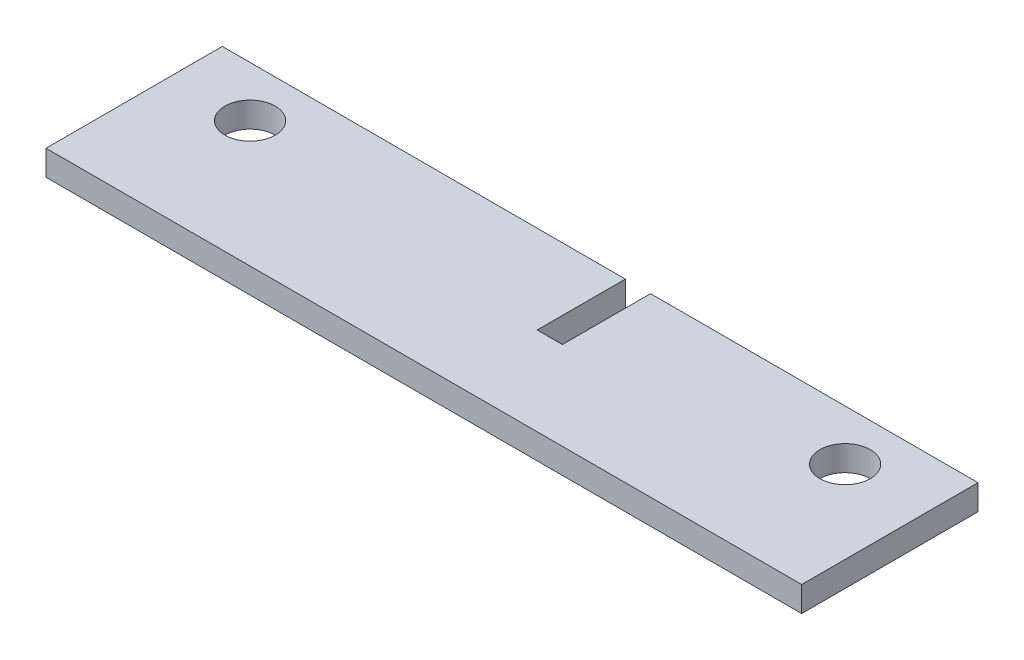
ISO-10303-21;
HEADER;
FILE_DESCRIPTION(('STEP AP214'),'2;1');
FILE_NAME('part.step','',(''),(''),'','','');
FILE_SCHEMA(('AUTOMOTIVE_DESIGN { 1 0 10303 214 1 1 1 1 }'));
ENDSEC;
DATA;
#1=APPLICATION_CONTEXT('core data for automotive mechanical design processes');
#2=APPLICATION_PROTOCOL_DEFINITION('international standard','automotive_design',2000,#1);
#3=PRODUCT_CONTEXT('',#1,'mechanical');
#4=PRODUCT('Part','Part','',(#3));
#5=PRODUCT_RELATED_PRODUCT_CATEGORY('part','',(#4));
#6=PRODUCT_DEFINITION_FORMATION('','',#4);
#7=PRODUCT_DEFINITION_CONTEXT('part definition',#1,'design');
#8=PRODUCT_DEFINITION('design','',#6,#7);
#9=PRODUCT_DEFINITION_SHAPE('','',#8);
#10=(LENGTH_UNIT() NAMED_UNIT(*) SI_UNIT(.MILLI.,.METRE.));
#11=(NAMED_UNIT(*) PLANE_ANGLE_UNIT() SI_UNIT($,.RADIAN.));
#12=(NAMED_UNIT(*) SI_UNIT($,.STERADIAN.) SOLID_ANGLE_UNIT());
#13=UNCERTAINTY_MEASURE_WITH_UNIT(LENGTH_MEASURE(1.E-05),#10,'distance_accuracy_value','');
#14=(GEOMETRIC_REPRESENTATION_CONTEXT(3) GLOBAL_UNCERTAINTY_ASSIGNED_CONTEXT((#13)) GLOBAL_UNIT_ASSIGNED_CONTEXT((#10,
#11,#12)) REPRESENTATION_CONTEXT('',''));
#15=CARTESIAN_POINT('',(0.,0.,0.));
#16=DIRECTION('',(0.,0.,1.));
#17=DIRECTION('',(1.,0.,0.));
#18=AXIS2_PLACEMENT_3D('',#15,#16,#17);
#19=CARTESIAN_POINT('',(0.,0.,249.6));
#20=DIRECTION('',(0.,0.,1.));
#21=DIRECTION('',(1.,0.,0.));
#22=AXIS2_PLACEMENT_3D('',#19,#20,#21);
#23=PLANE('',#22);
#24=DIRECTION('',(-1.,0.,0.));
#25=VECTOR('',#24,1.);
#26=CARTESIAN_POINT('',(2260.6,65.,249.6));
#27=LINE('',#26,#25);
#28=CARTESIAN_POINT('',(2463.8,65.,249.6));
#29=VERTEX_POINT('',#28);
#30=CARTESIAN_POINT('',(2260.6,65.,249.6));
#31=VERTEX_POINT('',#30);
#32=EDGE_CURVE('E180',#29,#31,#27,.T.);
#33=ORIENTED_EDGE('',*,*,#32,.F.);
#34=DIRECTION('',(0.,1.,0.));
#35=VECTOR('',#34,1.);
#36=CARTESIAN_POINT('',(2463.8,52.3,249.6));
#37=LINE('',#36,#35);
#38=CARTESIAN_POINT('',(2463.8,52.3,249.6));
#39=VERTEX_POINT('',#38);
#40=EDGE_CURVE('E151',#39,#29,#37,.T.);
#41=ORIENTED_EDGE('',*,*,#40,.F.);
#42=DIRECTION('',(1.,0.,0.));
#43=VECTOR('',#42,1.);
#44=CARTESIAN_POINT('',(2260.6,52.3,249.6));
#45=LINE('',#44,#43);
#46=CARTESIAN_POINT('',(2260.6,52.3,249.6));
#47=VERTEX_POINT('',#46);
#48=EDGE_CURVE('E144',#47,#39,#45,.T.);
#49=ORIENTED_EDGE('',*,*,#48,.F.);
#50=DIRECTION('',(0.,-1.,0.));
#51=VECTOR('',#50,1.);
#52=CARTESIAN_POINT('',(2260.6,65.,249.6));
#53=LINE('',#52,#51);
#54=EDGE_CURVE('E119',#31,#47,#53,.T.);
#55=ORIENTED_EDGE('',*,*,#54,.F.);
#56=EDGE_LOOP('',(#33,#41,#49,#55));
#57=FACE_BOUND('',#56,.T.);
#58=ADVANCED_FACE('F42',(#57),#23,.F.);
#59=CARTESIAN_POINT('',(2260.6,65.,249.6));
#60=DIRECTION('',(-1.,0.,0.));
#61=DIRECTION('',(0.,0.,1.));
#62=AXIS2_PLACEMENT_3D('',#59,#60,#61);
#63=PLANE('',#62);
#64=DIRECTION('',(0.,0.,1.));
#65=VECTOR('',#64,1.);
#66=CARTESIAN_POINT('',(2260.6,52.3,249.6));
#67=LINE('',#66,#65);
#68=CARTESIAN_POINT('',(2260.6,52.3,338.5));
#69=VERTEX_POINT('',#68);
#70=EDGE_CURVE('E112',#47,#69,#67,.T.);
#71=ORIENTED_EDGE('',*,*,#70,.T.);
#72=DIRECTION('',(0.,-1.,0.));
#73=VECTOR('',#72,1.);
#74=CARTESIAN_POINT('',(2260.6,65.,338.5));
#75=LINE('',#74,#73);
#76=CARTESIAN_POINT('',(2260.6,65.,338.5));
#77=VERTEX_POINT('',#76);
#78=EDGE_CURVE('E117',#77,#69,#75,.T.);
#79=ORIENTED_EDGE('',*,*,#78,.F.);
#80=DIRECTION('',(0.,0.,1.));
#81=VECTOR('',#80,1.);
#82=CARTESIAN_POINT('',(2260.6,65.,249.6));
#83=LINE('',#82,#81);
#84=EDGE_CURVE('E193',#31,#77,#83,.T.);
#85=ORIENTED_EDGE('',*,*,#84,.F.);
#86=ORIENTED_EDGE('',*,*,#54,.T.);
#87=EDGE_LOOP('',(#71,#79,#85,#86));
#88=FACE_BOUND('',#87,.T.);
#89=ADVANCED_FACE('F114',(#88),#63,.T.);
#90=CARTESIAN_POINT('',(2260.6,65.,249.6));
#91=DIRECTION('',(0.,1.,0.));
#92=DIRECTION('',(0.,0.,1.));
#93=AXIS2_PLACEMENT_3D('',#90,#91,#92);
#94=PLANE('',#93);
#95=CARTESIAN_POINT('',(2599.99999999996,65.,275.));
#96=DIRECTION('',(0.,1.,0.));
#97=DIRECTION('',(0.,0.,1.));
#98=AXIS2_PLACEMENT_3D('',#95,#96,#97);
#99=CIRCLE('',#98,12.6999999999999);
#100=CARTESIAN_POINT('',(2599.99999999996,64.9999999999999,262.3));
#101=VERTEX_POINT('',#100);
#102=EDGE_CURVE('E172',#101,#101,#99,.F.);
#103=ORIENTED_EDGE('',*,*,#102,.T.);
#104=EDGE_LOOP('',(#103));
#105=FACE_BOUND('',#104,.T.);
#106=CARTESIAN_POINT('',(2299.99999999996,65.,275.));
#107=DIRECTION('',(0.,1.,0.));
#108=DIRECTION('',(0.,0.,1.));
#109=AXIS2_PLACEMENT_3D('',#106,#107,#108);
#110=CIRCLE('',#109,12.6999999999999);
#111=CARTESIAN_POINT('',(2299.99999999996,65.,262.3));
#112=VERTEX_POINT('',#111);
#113=EDGE_CURVE('E46',#112,#112,#110,.F.);
#114=ORIENTED_EDGE('',*,*,#113,.T.);
#115=EDGE_LOOP('',(#114));
#116=FACE_BOUND('',#115,.T.);
#117=DIRECTION('',(0.,0.,1.));
#118=VECTOR('',#117,1.);
#119=CARTESIAN_POINT('',(2463.8,65.,249.6));
#120=LINE('',#119,#118);
#121=CARTESIAN_POINT('',(2463.8,65.,294.05));
#122=VERTEX_POINT('',#121);
#123=EDGE_CURVE('E154',#29,#122,#120,.T.);
#124=ORIENTED_EDGE('',*,*,#123,.F.);
#125=ORIENTED_EDGE('',*,*,#32,.T.);
#126=ORIENTED_EDGE('',*,*,#84,.T.);
#127=DIRECTION('',(-1.,0.,0.));
#128=VECTOR('',#127,1.);
#129=CARTESIAN_POINT('',(2260.6,65.,338.5));
#130=LINE('',#129,#128);
#131=CARTESIAN_POINT('',(2641.6,65.,338.5));
#132=VERTEX_POINT('',#131);
#133=EDGE_CURVE('E140',#132,#77,#130,.T.);
#134=ORIENTED_EDGE('',*,*,#133,.F.);
#135=DIRECTION('',(0.,0.,1.));
#136=VECTOR('',#135,1.);
#137=CARTESIAN_POINT('',(2641.6,65.,249.6));
#138=LINE('',#137,#136);
#139=CARTESIAN_POINT('',(2641.6,65.,249.6));
#140=VERTEX_POINT('',#139);
#141=EDGE_CURVE('E191',#140,#132,#138,.T.);
#142=ORIENTED_EDGE('',*,*,#141,.F.);
#143=CARTESIAN_POINT('',(2476.5,65.,249.6));
#144=VERTEX_POINT('',#143);
#145=EDGE_CURVE('E196',#140,#144,#27,.T.);
#146=ORIENTED_EDGE('',*,*,#145,.T.);
#147=DIRECTION('',(0.,0.,-1.));
#148=VECTOR('',#147,1.);
#149=CARTESIAN_POINT('',(2476.5,65.,249.6));
#150=LINE('',#149,#148);
#151=CARTESIAN_POINT('',(2476.5,65.,294.05));
#152=VERTEX_POINT('',#151);
#153=EDGE_CURVE('E83',#152,#144,#150,.T.);
#154=ORIENTED_EDGE('',*,*,#153,.F.);
#155=DIRECTION('',(1.,0.,0.));
#156=VECTOR('',#155,1.);
#157=CARTESIAN_POINT('',(2463.8,65.,294.05));
#158=LINE('',#157,#156);
#159=EDGE_CURVE('E53',#122,#152,#158,.T.);
#160=ORIENTED_EDGE('',*,*,#159,.F.);
#161=EDGE_LOOP('',(#124,#125,#126,#134,#142,#146,#154,#160));
#162=FACE_BOUND('',#161,.T.);
#163=ADVANCED_FACE('F44',(#105,#116,#162),#94,.T.);
#164=CARTESIAN_POINT('',(2641.6,65.,249.6));
#165=DIRECTION('',(1.,0.,0.));
#166=DIRECTION('',(0.,0.,-1.));
#167=AXIS2_PLACEMENT_3D('',#164,#165,#166);
#168=PLANE('',#167);
#169=ORIENTED_EDGE('',*,*,#141,.T.);
#170=DIRECTION('',(0.,1.,0.));
#171=VECTOR('',#170,1.);
#172=CARTESIAN_POINT('',(2641.6,65.,338.5));
#173=LINE('',#172,#171);
#174=CARTESIAN_POINT('',(2641.6,52.3,338.5));
#175=VERTEX_POINT('',#174);
#176=EDGE_CURVE('E135',#175,#132,#173,.T.);
#177=ORIENTED_EDGE('',*,*,#176,.F.);
#178=DIRECTION('',(0.,0.,1.));
#179=VECTOR('',#178,1.);
#180=CARTESIAN_POINT('',(2641.6,52.3,249.6));
#181=LINE('',#180,#179);
#182=CARTESIAN_POINT('',(2641.6,52.3,249.6));
#183=VERTEX_POINT('',#182);
#184=EDGE_CURVE('E130',#183,#175,#181,.T.);
#185=ORIENTED_EDGE('',*,*,#184,.F.);
#186=DIRECTION('',(0.,1.,0.));
#187=VECTOR('',#186,1.);
#188=CARTESIAN_POINT('',(2641.6,65.,249.6));
#189=LINE('',#188,#187);
#190=EDGE_CURVE('E203',#183,#140,#189,.T.);
#191=ORIENTED_EDGE('',*,*,#190,.T.);
#192=EDGE_LOOP('',(#169,#177,#185,#191));
#193=FACE_BOUND('',#192,.T.);
#194=ADVANCED_FACE('F212',(#193),#168,.T.);
#195=CARTESIAN_POINT('',(2260.6,52.3,249.6));
#196=DIRECTION('',(0.,-1.,0.));
#197=DIRECTION('',(0.,0.,-1.));
#198=AXIS2_PLACEMENT_3D('',#195,#196,#197);
#199=PLANE('',#198);
#200=CARTESIAN_POINT('',(2599.99999999996,52.3,275.));
#201=DIRECTION('',(0.,-1.,0.));
#202=DIRECTION('',(0.,0.,-1.));
#203=AXIS2_PLACEMENT_3D('',#200,#201,#202);
#204=CIRCLE('',#203,12.6999999999999);
#205=CARTESIAN_POINT('',(2599.99999999996,52.3,262.3));
#206=VERTEX_POINT('',#205);
#207=EDGE_CURVE('E205',#206,#206,#204,.F.);
#208=ORIENTED_EDGE('',*,*,#207,.T.);
#209=EDGE_LOOP('',(#208));
#210=FACE_BOUND('',#209,.T.);
#211=CARTESIAN_POINT('',(2299.99999999996,52.3,275.));
#212=DIRECTION('',(0.,-1.,0.));
#213=DIRECTION('',(0.,0.,-1.));
#214=AXIS2_PLACEMENT_3D('',#211,#212,#213);
#215=CIRCLE('',#214,12.6999999999999);
#216=CARTESIAN_POINT('',(2299.99999999996,52.3,262.3));
#217=VERTEX_POINT('',#216);
#218=EDGE_CURVE('E171',#217,#217,#215,.F.);
#219=ORIENTED_EDGE('',*,*,#218,.T.);
#220=EDGE_LOOP('',(#219));
#221=FACE_BOUND('',#220,.T.);
#222=DIRECTION('',(0.,0.,1.));
#223=VECTOR('',#222,1.);
#224=CARTESIAN_POINT('',(2463.8,52.3,249.6));
#225=LINE('',#224,#223);
#226=CARTESIAN_POINT('',(2463.8,52.3,294.05));
#227=VERTEX_POINT('',#226);
#228=EDGE_CURVE('E169',#39,#227,#225,.T.);
#229=ORIENTED_EDGE('',*,*,#228,.T.);
#230=DIRECTION('',(1.,0.,0.));
#231=VECTOR('',#230,1.);
#232=CARTESIAN_POINT('',(2463.8,52.3,294.05));
#233=LINE('',#232,#231);
#234=CARTESIAN_POINT('',(2476.5,52.3,294.05));
#235=VERTEX_POINT('',#234);
#236=EDGE_CURVE('E165',#227,#235,#233,.T.);
#237=ORIENTED_EDGE('',*,*,#236,.T.);
#238=DIRECTION('',(0.,0.,-1.));
#239=VECTOR('',#238,1.);
#240=CARTESIAN_POINT('',(2476.5,52.3,249.6));
#241=LINE('',#240,#239);
#242=CARTESIAN_POINT('',(2476.5,52.3,249.6));
#243=VERTEX_POINT('',#242);
#244=EDGE_CURVE('E161',#235,#243,#241,.T.);
#245=ORIENTED_EDGE('',*,*,#244,.T.);
#246=EDGE_CURVE('E164',#243,#183,#45,.T.);
#247=ORIENTED_EDGE('',*,*,#246,.T.);
#248=ORIENTED_EDGE('',*,*,#184,.T.);
#249=DIRECTION('',(1.,0.,0.));
#250=VECTOR('',#249,1.);
#251=CARTESIAN_POINT('',(2260.6,52.3,338.5));
#252=LINE('',#251,#250);
#253=EDGE_CURVE('E126',#69,#175,#252,.T.);
#254=ORIENTED_EDGE('',*,*,#253,.F.);
#255=ORIENTED_EDGE('',*,*,#70,.F.);
#256=ORIENTED_EDGE('',*,*,#48,.T.);
#257=EDGE_LOOP('',(#229,#237,#245,#247,#248,#254,#255,#256));
#258=FACE_BOUND('',#257,.T.);
#259=ADVANCED_FACE('F128',(#210,#221,#258),#199,.T.);
#260=ORIENTED_EDGE('',*,*,#246,.F.);
#261=DIRECTION('',(0.,1.,0.));
#262=VECTOR('',#261,1.);
#263=CARTESIAN_POINT('',(2476.5,52.3,249.6));
#264=LINE('',#263,#262);
#265=EDGE_CURVE('E78',#243,#144,#264,.T.);
#266=ORIENTED_EDGE('',*,*,#265,.T.);
#267=ORIENTED_EDGE('',*,*,#145,.F.);
#268=ORIENTED_EDGE('',*,*,#190,.F.);
#269=EDGE_LOOP('',(#260,#266,#267,#268));
#270=FACE_BOUND('',#269,.T.);
#271=ADVANCED_FACE('F219',(#270),#23,.F.);
#272=CARTESIAN_POINT('',(0.,0.,338.5));
#273=DIRECTION('',(0.,0.,1.));
#274=DIRECTION('',(1.,0.,0.));
#275=AXIS2_PLACEMENT_3D('',#272,#273,#274);
#276=PLANE('',#275);
#277=ORIENTED_EDGE('',*,*,#78,.T.);
#278=ORIENTED_EDGE('',*,*,#253,.T.);
#279=ORIENTED_EDGE('',*,*,#176,.T.);
#280=ORIENTED_EDGE('',*,*,#133,.T.);
#281=EDGE_LOOP('',(#277,#278,#279,#280));
#282=FACE_BOUND('',#281,.T.);
#283=ADVANCED_FACE('F138',(#282),#276,.T.);
#284=CARTESIAN_POINT('',(2463.8,52.3,249.6));
#285=DIRECTION('',(-1.,0.,0.));
#286=DIRECTION('',(0.,0.,1.));
#287=AXIS2_PLACEMENT_3D('',#284,#285,#286);
#288=PLANE('',#287);
#289=ORIENTED_EDGE('',*,*,#123,.T.);
#290=DIRECTION('',(0.,1.,0.));
#291=VECTOR('',#290,1.);
#292=CARTESIAN_POINT('',(2463.8,52.3,294.05));
#293=LINE('',#292,#291);
#294=EDGE_CURVE('E11',#227,#122,#293,.T.);
#295=ORIENTED_EDGE('',*,*,#294,.F.);
#296=ORIENTED_EDGE('',*,*,#228,.F.);
#297=ORIENTED_EDGE('',*,*,#40,.T.);
#298=EDGE_LOOP('',(#289,#295,#296,#297));
#299=FACE_BOUND('',#298,.T.);
#300=ADVANCED_FACE('F234',(#299),#288,.F.);
#301=CARTESIAN_POINT('',(2476.5,52.3,249.6));
#302=DIRECTION('',(1.,0.,0.));
#303=DIRECTION('',(0.,0.,-1.));
#304=AXIS2_PLACEMENT_3D('',#301,#302,#303);
#305=PLANE('',#304);
#306=ORIENTED_EDGE('',*,*,#153,.T.);
#307=ORIENTED_EDGE('',*,*,#265,.F.);
#308=ORIENTED_EDGE('',*,*,#244,.F.);
#309=DIRECTION('',(0.,1.,0.));
#310=VECTOR('',#309,1.);
#311=CARTESIAN_POINT('',(2476.5,52.3,294.05));
#312=LINE('',#311,#310);
#313=EDGE_CURVE('E148',#235,#152,#312,.T.);
#314=ORIENTED_EDGE('',*,*,#313,.T.);
#315=EDGE_LOOP('',(#306,#307,#308,#314));
#316=FACE_BOUND('',#315,.T.);
#317=ADVANCED_FACE('F243',(#316),#305,.F.);
#318=CARTESIAN_POINT('',(2463.8,52.3,294.05));
#319=DIRECTION('',(0.,0.,1.));
#320=DIRECTION('',(1.,0.,0.));
#321=AXIS2_PLACEMENT_3D('',#318,#319,#320);
#322=PLANE('',#321);
#323=ORIENTED_EDGE('',*,*,#159,.T.);
#324=ORIENTED_EDGE('',*,*,#313,.F.);
#325=ORIENTED_EDGE('',*,*,#236,.F.);
#326=ORIENTED_EDGE('',*,*,#294,.T.);
#327=EDGE_LOOP('',(#323,#324,#325,#326));
#328=FACE_BOUND('',#327,.T.);
#329=ADVANCED_FACE('F242',(#328),#322,.F.);
#330=CARTESIAN_POINT('',(2299.99999999996,181.249999999996,275.));
#331=DIRECTION('',(0.,-1.,0.));
#332=DIRECTION('',(0.,0.,-1.));
#333=AXIS2_PLACEMENT_3D('',#330,#331,#332);
#334=CYLINDRICAL_SURFACE('',#333,12.6999999999999);
#335=CARTESIAN_POINT('',(2299.99999999996,65.,262.3));
#336=CARTESIAN_POINT('',(2299.99999999996,64.8677083333333,262.3));
#337=CARTESIAN_POINT('',(2299.99999999996,64.7354166666666,262.3));
#338=CARTESIAN_POINT('',(2299.99999999996,64.4708333333333,262.3));
#339=CARTESIAN_POINT('',(2299.99999999996,64.3385416666666,262.3));
#340=CARTESIAN_POINT('',(2299.99999999996,64.0739583333333,262.3));
#341=CARTESIAN_POINT('',(2299.99999999996,63.9416666666666,262.3));
#342=CARTESIAN_POINT('',(2299.99999999996,63.6770833333333,262.3));
#343=CARTESIAN_POINT('',(2299.99999999996,63.5447916666666,262.3));
#344=CARTESIAN_POINT('',(2299.99999999996,63.2802083333333,262.3));
#345=CARTESIAN_POINT('',(2299.99999999996,63.1479166666666,262.3));
#346=CARTESIAN_POINT('',(2299.99999999996,62.8833333333333,262.3));
#347=CARTESIAN_POINT('',(2299.99999999996,62.7510416666666,262.3));
#348=CARTESIAN_POINT('',(2299.99999999996,62.4864583333333,262.3));
#349=CARTESIAN_POINT('',(2299.99999999996,62.3541666666666,262.3));
#350=CARTESIAN_POINT('',(2299.99999999996,62.0895833333333,262.3));
#351=CARTESIAN_POINT('',(2299.99999999996,61.9572916666666,262.3));
#352=CARTESIAN_POINT('',(2299.99999999996,61.6927083333333,262.3));
#353=CARTESIAN_POINT('',(2299.99999999996,61.5604166666666,262.3));
#354=CARTESIAN_POINT('',(2299.99999999996,61.2958333333333,262.3));
#355=CARTESIAN_POINT('',(2299.99999999996,61.1635416666666,262.3));
#356=CARTESIAN_POINT('',(2299.99999999996,60.8989583333333,262.3));
#357=CARTESIAN_POINT('',(2299.99999999996,60.7666666666666,262.3));
#358=CARTESIAN_POINT('',(2299.99999999996,60.5020833333333,262.3));
#359=CARTESIAN_POINT('',(2299.99999999996,60.3697916666666,262.3));
#360=CARTESIAN_POINT('',(2299.99999999996,60.1052083333333,262.3));
#361=CARTESIAN_POINT('',(2299.99999999996,59.9729166666666,262.3));
#362=CARTESIAN_POINT('',(2299.99999999996,59.7083333333333,262.3));
#363=CARTESIAN_POINT('',(2299.99999999996,59.5760416666666,262.3));
#364=CARTESIAN_POINT('',(2299.99999999996,59.3114583333333,262.3));
#365=CARTESIAN_POINT('',(2299.99999999996,59.1791666666666,262.3));
#366=CARTESIAN_POINT('',(2299.99999999996,58.9145833333333,262.3));
#367=CARTESIAN_POINT('',(2299.99999999996,58.7822916666666,262.3));
#368=CARTESIAN_POINT('',(2299.99999999996,58.5177083333333,262.3));
#369=CARTESIAN_POINT('',(2299.99999999996,58.3854166666666,262.3));
#370=CARTESIAN_POINT('',(2299.99999999996,58.1208333333333,262.3));
#371=CARTESIAN_POINT('',(2299.99999999996,57.9885416666666,262.3));
#372=CARTESIAN_POINT('',(2299.99999999996,57.7239583333333,262.3));
#373=CARTESIAN_POINT('',(2299.99999999996,57.5916666666666,262.3));
#374=CARTESIAN_POINT('',(2299.99999999996,57.3270833333333,262.3));
#375=CARTESIAN_POINT('',(2299.99999999996,57.1947916666666,262.3));
#376=CARTESIAN_POINT('',(2299.99999999996,56.9302083333333,262.3));
#377=CARTESIAN_POINT('',(2299.99999999996,56.7979166666666,262.3));
#378=CARTESIAN_POINT('',(2299.99999999996,56.5333333333333,262.3));
#379=CARTESIAN_POINT('',(2299.99999999996,56.4010416666666,262.3));
#380=CARTESIAN_POINT('',(2299.99999999996,56.1364583333333,262.3));
#381=CARTESIAN_POINT('',(2299.99999999996,56.0041666666666,262.3));
#382=CARTESIAN_POINT('',(2299.99999999996,55.7395833333333,262.3));
#383=CARTESIAN_POINT('',(2299.99999999996,55.6072916666666,262.3));
#384=CARTESIAN_POINT('',(2299.99999999996,55.3427083333333,262.3));
#385=CARTESIAN_POINT('',(2299.99999999996,55.2104166666666,262.3));
#386=CARTESIAN_POINT('',(2299.99999999996,54.9458333333333,262.3));
#387=CARTESIAN_POINT('',(2299.99999999996,54.8135416666666,262.3));
#388=CARTESIAN_POINT('',(2299.99999999996,54.5489583333333,262.3));
#389=CARTESIAN_POINT('',(2299.99999999996,54.4166666666666,262.3));
#390=CARTESIAN_POINT('',(2299.99999999996,54.1520833333333,262.3));
#391=CARTESIAN_POINT('',(2299.99999999996,54.0197916666666,262.3));
#392=CARTESIAN_POINT('',(2299.99999999996,53.7552083333333,262.3));
#393=CARTESIAN_POINT('',(2299.99999999996,53.6229166666666,262.3));
#394=CARTESIAN_POINT('',(2299.99999999996,53.3583333333333,262.3));
#395=CARTESIAN_POINT('',(2299.99999999996,53.2260416666666,262.3));
#396=CARTESIAN_POINT('',(2299.99999999996,52.9614583333333,262.3));
#397=CARTESIAN_POINT('',(2299.99999999996,52.8291666666666,262.3));
#398=CARTESIAN_POINT('',(2299.99999999996,52.5645833333333,262.3));
#399=CARTESIAN_POINT('',(2299.99999999996,52.4322916666666,262.3));
#400=CARTESIAN_POINT('',(2299.99999999996,52.3,262.3));
#401=B_SPLINE_CURVE_WITH_KNOTS('',3,(#335,#336,#337,#338,#339,#340,#341,#342,#343,#344,#345,
#346,#347,#348,#349,#350,#351,#352,#353,#354,#355,#356,#357,#358,#359,#360,#361,#362,#363,#364,
#365,#366,#367,#368,#369,#370,#371,#372,#373,#374,#375,#376,#377,#378,#379,#380,#381,#382,#383,
#384,#385,#386,#387,#388,#389,#390,#391,#392,#393,#394,#395,#396,#397,#398,#399,#400),
.UNSPECIFIED.,.F.,.F.,(4,2,2,2,2,2,2,2,2,2,2,2,2,2,2,2,2,2,2,2,2,2,2,2,2,2,2,2,2,2,2,2,4),(0.,
0.396875000000005,0.793749999999996,1.190625,1.58750000000001,1.984375,2.38125,2.77812500000001,
3.17500000000001,3.571875,3.96875000000001,4.36562500000001,4.7625,5.15937500000001,
5.55625000000001,5.953125,6.35000000000001,6.74687500000001,7.14375,7.54062500000001,
7.93750000000001,8.334375,8.73125000000001,9.12812500000001,9.52500000000001,9.92187500000002,
10.31875,10.715625,11.1125,11.509375,11.90625,12.303125,12.7),.UNSPECIFIED.);
#402=EDGE_CURVE('BSEAM250',#112,#217,#401,.T.);
#403=ORIENTED_EDGE('',*,*,#113,.F.);
#404=ORIENTED_EDGE('',*,*,#218,.F.);
#405=ORIENTED_EDGE('',*,*,#402,.T.);
#406=ORIENTED_EDGE('',*,*,#402,.F.);
#407=EDGE_LOOP('',(#403,#405,#404,#406));
#408=FACE_BOUND('',#407,.T.);
#409=ADVANCED_FACE('F250',(#408),#334,.F.);
#410=CARTESIAN_POINT('',(2599.99999999996,289.999999999996,275.));
#411=DIRECTION('',(0.,-1.,0.));
#412=DIRECTION('',(0.,0.,-1.));
#413=AXIS2_PLACEMENT_3D('',#410,#411,#412);
#414=CYLINDRICAL_SURFACE('',#413,12.6999999999999);
#415=CARTESIAN_POINT('',(2599.99999999996,64.9999999999999,262.3));
#416=CARTESIAN_POINT('',(2599.99999999996,64.8677083333333,262.3));
#417=CARTESIAN_POINT('',(2599.99999999996,64.7354166666666,262.3));
#418=CARTESIAN_POINT('',(2599.99999999996,64.4708333333333,262.3));
#419=CARTESIAN_POINT('',(2599.99999999996,64.3385416666666,262.3));
#420=CARTESIAN_POINT('',(2599.99999999996,64.0739583333333,262.3));
#421=CARTESIAN_POINT('',(2599.99999999996,63.9416666666666,262.3));
#422=CARTESIAN_POINT('',(2599.99999999996,63.6770833333333,262.3));
#423=CARTESIAN_POINT('',(2599.99999999996,63.5447916666666,262.3));
#424=CARTESIAN_POINT('',(2599.99999999996,63.2802083333333,262.3));
#425=CARTESIAN_POINT('',(2599.99999999996,63.1479166666666,262.3));
#426=CARTESIAN_POINT('',(2599.99999999996,62.8833333333333,262.3));
#427=CARTESIAN_POINT('',(2599.99999999996,62.7510416666666,262.3));
#428=CARTESIAN_POINT('',(2599.99999999996,62.4864583333333,262.3));
#429=CARTESIAN_POINT('',(2599.99999999996,62.3541666666666,262.3));
#430=CARTESIAN_POINT('',(2599.99999999996,62.0895833333333,262.3));
#431=CARTESIAN_POINT('',(2599.99999999996,61.9572916666666,262.3));
#432=CARTESIAN_POINT('',(2599.99999999996,61.6927083333333,262.3));
#433=CARTESIAN_POINT('',(2599.99999999996,61.5604166666666,262.3));
#434=CARTESIAN_POINT('',(2599.99999999996,61.2958333333333,262.3));
#435=CARTESIAN_POINT('',(2599.99999999996,61.1635416666666,262.3));
#436=CARTESIAN_POINT('',(2599.99999999996,60.8989583333333,262.3));
#437=CARTESIAN_POINT('',(2599.99999999996,60.7666666666666,262.3));
#438=CARTESIAN_POINT('',(2599.99999999996,60.5020833333333,262.3));
#439=CARTESIAN_POINT('',(2599.99999999996,60.3697916666666,262.3));
#440=CARTESIAN_POINT('',(2599.99999999996,60.1052083333333,262.3));
#441=CARTESIAN_POINT('',(2599.99999999996,59.9729166666666,262.3));
#442=CARTESIAN_POINT('',(2599.99999999996,59.7083333333333,262.3));
#443=CARTESIAN_POINT('',(2599.99999999996,59.5760416666666,262.3));
#444=CARTESIAN_POINT('',(2599.99999999996,59.3114583333333,262.3));
#445=CARTESIAN_POINT('',(2599.99999999996,59.1791666666666,262.3));
#446=CARTESIAN_POINT('',(2599.99999999996,58.9145833333333,262.3));
#447=CARTESIAN_POINT('',(2599.99999999996,58.7822916666666,262.3));
#448=CARTESIAN_POINT('',(2599.99999999996,58.5177083333333,262.3));
#449=CARTESIAN_POINT('',(2599.99999999996,58.3854166666666,262.3));
#450=CARTESIAN_POINT('',(2599.99999999996,58.1208333333333,262.3));
#451=CARTESIAN_POINT('',(2599.99999999996,57.9885416666666,262.3));
#452=CARTESIAN_POINT('',(2599.99999999996,57.7239583333333,262.3));
#453=CARTESIAN_POINT('',(2599.99999999996,57.5916666666666,262.3));
#454=CARTESIAN_POINT('',(2599.99999999996,57.3270833333333,262.3));
#455=CARTESIAN_POINT('',(2599.99999999996,57.1947916666666,262.3));
#456=CARTESIAN_POINT('',(2599.99999999996,56.9302083333333,262.3));
#457=CARTESIAN_POINT('',(2599.99999999996,56.7979166666666,262.3));
#458=CARTESIAN_POINT('',(2599.99999999996,56.5333333333333,262.3));
#459=CARTESIAN_POINT('',(2599.99999999996,56.4010416666666,262.3));
#460=CARTESIAN_POINT('',(2599.99999999996,56.1364583333333,262.3));
#461=CARTESIAN_POINT('',(2599.99999999996,56.0041666666666,262.3));
#462=CARTESIAN_POINT('',(2599.99999999996,55.7395833333333,262.3));
#463=CARTESIAN_POINT('',(2599.99999999996,55.6072916666666,262.3));
#464=CARTESIAN_POINT('',(2599.99999999996,55.3427083333333,262.3));
#465=CARTESIAN_POINT('',(2599.99999999996,55.2104166666666,262.3));
#466=CARTESIAN_POINT('',(2599.99999999996,54.9458333333333,262.3));
#467=CARTESIAN_POINT('',(2599.99999999996,54.8135416666666,262.3));
#468=CARTESIAN_POINT('',(2599.99999999996,54.5489583333333,262.3));
#469=CARTESIAN_POINT('',(2599.99999999996,54.4166666666666,262.3));
#470=CARTESIAN_POINT('',(2599.99999999996,54.1520833333333,262.3));
#471=CARTESIAN_POINT('',(2599.99999999996,54.0197916666666,262.3));
#472=CARTESIAN_POINT('',(2599.99999999996,53.7552083333333,262.3));
#473=CARTESIAN_POINT('',(2599.99999999996,53.6229166666666,262.3));
#474=CARTESIAN_POINT('',(2599.99999999996,53.3583333333333,262.3));
#475=CARTESIAN_POINT('',(2599.99999999996,53.2260416666666,262.3));
#476=CARTESIAN_POINT('',(2599.99999999996,52.9614583333333,262.3));
#477=CARTESIAN_POINT('',(2599.99999999996,52.8291666666666,262.3));
#478=CARTESIAN_POINT('',(2599.99999999996,52.5645833333333,262.3));
#479=CARTESIAN_POINT('',(2599.99999999996,52.4322916666666,262.3));
#480=CARTESIAN_POINT('',(2599.99999999996,52.3,262.3));
#481=B_SPLINE_CURVE_WITH_KNOTS('',3,(#415,#416,#417,#418,#419,#420,#421,#422,#423,#424,#425,
#426,#427,#428,#429,#430,#431,#432,#433,#434,#435,#436,#437,#438,#439,#440,#441,#442,#443,#444,
#445,#446,#447,#448,#449,#450,#451,#452,#453,#454,#455,#456,#457,#458,#459,#460,#461,#462,#463,
#464,#465,#466,#467,#468,#469,#470,#471,#472,#473,#474,#475,#476,#477,#478,#479,#480),
.UNSPECIFIED.,.F.,.F.,(4,2,2,2,2,2,2,2,2,2,2,2,2,2,2,2,2,2,2,2,2,2,2,2,2,2,2,2,2,2,2,2,4),(0.,
0.396874999999991,0.79375000000001,1.190625,1.58749999999999,1.98437500000001,2.38125,
2.77812499999999,3.17499999999998,3.571875,3.96874999999999,4.36562499999998,4.7625,
5.15937499999999,5.55624999999998,5.953125,6.34999999999999,6.74687499999999,7.14375,7.540625,
7.93749999999999,8.334375,8.73125,9.12812499999999,9.52500000000001,9.921875,10.31875,10.715625,
11.1125,11.509375,11.90625,12.303125,12.7),.UNSPECIFIED.);
#482=EDGE_CURVE('BSEAM254',#101,#206,#481,.T.);
#483=ORIENTED_EDGE('',*,*,#102,.F.);
#484=ORIENTED_EDGE('',*,*,#207,.F.);
#485=ORIENTED_EDGE('',*,*,#482,.T.);
#486=ORIENTED_EDGE('',*,*,#482,.F.);
#487=EDGE_LOOP('',(#483,#485,#484,#486));
#488=FACE_BOUND('',#487,.T.);
#489=ADVANCED_FACE('F254',(#488),#414,.F.);
#490=CLOSED_SHELL('',(#58,#89,#163,#194,#259,#271,#283,#300,#317,#329,#409,#489));
#491=MANIFOLD_SOLID_BREP('B2',#490);
#492=ADVANCED_BREP_SHAPE_REPRESENTATION('',(#18,#491),#14);
#493=SHAPE_DEFINITION_REPRESENTATION(#9,#492);
ENDSEC;
END-ISO-10303-21;
